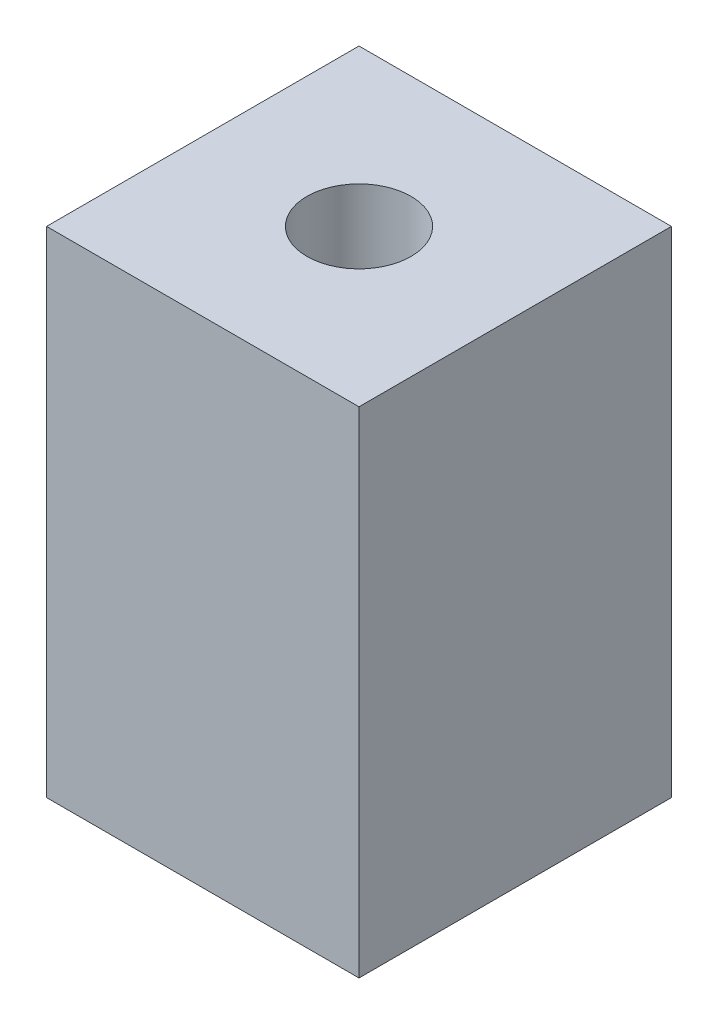
ISO-10303-21;
HEADER;
FILE_DESCRIPTION(('STEP AP214'),'2;1');
FILE_NAME('part.step','',(''),(''),'','','');
FILE_SCHEMA(('AUTOMOTIVE_DESIGN { 1 0 10303 214 1 1 1 1 }'));
ENDSEC;
DATA;
#1=APPLICATION_CONTEXT('core data for automotive mechanical design processes');
#2=APPLICATION_PROTOCOL_DEFINITION('international standard','automotive_design',2000,#1);
#3=PRODUCT_CONTEXT('',#1,'mechanical');
#4=PRODUCT('Part','Part','',(#3));
#5=PRODUCT_RELATED_PRODUCT_CATEGORY('part','',(#4));
#6=PRODUCT_DEFINITION_FORMATION('','',#4);
#7=PRODUCT_DEFINITION_CONTEXT('part definition',#1,'design');
#8=PRODUCT_DEFINITION('design','',#6,#7);
#9=PRODUCT_DEFINITION_SHAPE('','',#8);
#10=(LENGTH_UNIT() NAMED_UNIT(*) SI_UNIT(.MILLI.,.METRE.));
#11=(NAMED_UNIT(*) PLANE_ANGLE_UNIT() SI_UNIT($,.RADIAN.));
#12=(NAMED_UNIT(*) SI_UNIT($,.STERADIAN.) SOLID_ANGLE_UNIT());
#13=UNCERTAINTY_MEASURE_WITH_UNIT(LENGTH_MEASURE(1.E-05),#10,'distance_accuracy_value','');
#14=(GEOMETRIC_REPRESENTATION_CONTEXT(3) GLOBAL_UNCERTAINTY_ASSIGNED_CONTEXT((#13)) GLOBAL_UNIT_ASSIGNED_CONTEXT((#10,
#11,#12)) REPRESENTATION_CONTEXT('',''));
#15=CARTESIAN_POINT('',(0.,0.,0.));
#16=DIRECTION('',(0.,0.,1.));
#17=DIRECTION('',(1.,0.,0.));
#18=AXIS2_PLACEMENT_3D('',#15,#16,#17);
#19=CARTESIAN_POINT('',(0.,19.,0.));
#20=DIRECTION('',(0.,1.,0.));
#21=DIRECTION('',(0.,0.,1.));
#22=AXIS2_PLACEMENT_3D('',#19,#20,#21);
#23=PLANE('',#22);
#24=DIRECTION('',(0.,0.,-1.));
#25=VECTOR('',#24,1.);
#26=CARTESIAN_POINT('',(6.,19.,-6.));
#27=LINE('',#26,#25);
#28=CARTESIAN_POINT('',(6.,19.,6.));
#29=VERTEX_POINT('',#28);
#30=CARTESIAN_POINT('',(6.,19.,-6.));
#31=VERTEX_POINT('',#30);
#32=EDGE_CURVE('E89',#29,#31,#27,.T.);
#33=ORIENTED_EDGE('',*,*,#32,.T.);
#34=DIRECTION('',(-1.,0.,0.));
#35=VECTOR('',#34,1.);
#36=CARTESIAN_POINT('',(-6.,19.,-6.));
#37=LINE('',#36,#35);
#38=CARTESIAN_POINT('',(-6.,19.,-6.));
#39=VERTEX_POINT('',#38);
#40=EDGE_CURVE('E84',#31,#39,#37,.T.);
#41=ORIENTED_EDGE('',*,*,#40,.T.);
#42=DIRECTION('',(0.,0.,1.));
#43=VECTOR('',#42,1.);
#44=CARTESIAN_POINT('',(-6.,19.,-6.));
#45=LINE('',#44,#43);
#46=CARTESIAN_POINT('',(-6.,19.,6.));
#47=VERTEX_POINT('',#46);
#48=EDGE_CURVE('E87',#39,#47,#45,.T.);
#49=ORIENTED_EDGE('',*,*,#48,.T.);
#50=DIRECTION('',(1.,0.,0.));
#51=VECTOR('',#50,1.);
#52=CARTESIAN_POINT('',(-6.,19.,6.));
#53=LINE('',#52,#51);
#54=EDGE_CURVE('E54',#47,#29,#53,.T.);
#55=ORIENTED_EDGE('',*,*,#54,.T.);
#56=EDGE_LOOP('',(#33,#41,#49,#55));
#57=FACE_BOUND('',#56,.T.);
#58=CARTESIAN_POINT('',(0.,19.,0.));
#59=DIRECTION('',(0.,1.,0.));
#60=DIRECTION('',(0.,0.,1.));
#61=AXIS2_PLACEMENT_3D('',#58,#59,#60);
#62=CIRCLE('',#61,2.);
#63=CARTESIAN_POINT('',(0.,19.,2.));
#64=VERTEX_POINT('',#63);
#65=EDGE_CURVE('E104',#64,#64,#62,.T.);
#66=ORIENTED_EDGE('',*,*,#65,.F.);
#67=EDGE_LOOP('',(#66));
#68=FACE_BOUND('',#67,.T.);
#69=ADVANCED_FACE('F37',(#57,#68),#23,.T.);
#70=CARTESIAN_POINT('',(0.,0.,0.));
#71=DIRECTION('',(0.,1.,0.));
#72=DIRECTION('',(0.,0.,1.));
#73=AXIS2_PLACEMENT_3D('',#70,#71,#72);
#74=PLANE('',#73);
#75=DIRECTION('',(0.,0.,-1.));
#76=VECTOR('',#75,1.);
#77=CARTESIAN_POINT('',(6.,0.,-6.));
#78=LINE('',#77,#76);
#79=CARTESIAN_POINT('',(6.,0.,6.));
#80=VERTEX_POINT('',#79);
#81=CARTESIAN_POINT('',(6.,0.,-6.));
#82=VERTEX_POINT('',#81);
#83=EDGE_CURVE('E101',#80,#82,#78,.T.);
#84=ORIENTED_EDGE('',*,*,#83,.F.);
#85=DIRECTION('',(1.,0.,0.));
#86=VECTOR('',#85,1.);
#87=CARTESIAN_POINT('',(-6.,0.,6.));
#88=LINE('',#87,#86);
#89=CARTESIAN_POINT('',(-6.,0.,6.));
#90=VERTEX_POINT('',#89);
#91=EDGE_CURVE('E77',#90,#80,#88,.T.);
#92=ORIENTED_EDGE('',*,*,#91,.F.);
#93=DIRECTION('',(0.,0.,1.));
#94=VECTOR('',#93,1.);
#95=CARTESIAN_POINT('',(-6.,0.,-6.));
#96=LINE('',#95,#94);
#97=CARTESIAN_POINT('',(-6.,0.,-6.));
#98=VERTEX_POINT('',#97);
#99=EDGE_CURVE('E71',#98,#90,#96,.T.);
#100=ORIENTED_EDGE('',*,*,#99,.F.);
#101=DIRECTION('',(-1.,0.,0.));
#102=VECTOR('',#101,1.);
#103=CARTESIAN_POINT('',(-6.,0.,-6.));
#104=LINE('',#103,#102);
#105=EDGE_CURVE('E93',#82,#98,#104,.T.);
#106=ORIENTED_EDGE('',*,*,#105,.F.);
#107=EDGE_LOOP('',(#84,#92,#100,#106));
#108=FACE_BOUND('',#107,.T.);
#109=CARTESIAN_POINT('',(0.,0.,0.));
#110=DIRECTION('',(0.,1.,0.));
#111=DIRECTION('',(0.,0.,1.));
#112=AXIS2_PLACEMENT_3D('',#109,#110,#111);
#113=CIRCLE('',#112,2.);
#114=CARTESIAN_POINT('',(0.,0.,2.));
#115=VERTEX_POINT('',#114);
#116=EDGE_CURVE('E116',#115,#115,#113,.T.);
#117=ORIENTED_EDGE('',*,*,#116,.T.);
#118=EDGE_LOOP('',(#117));
#119=FACE_BOUND('',#118,.T.);
#120=ADVANCED_FACE('F112',(#108,#119),#74,.F.);
#121=CARTESIAN_POINT('',(6.,19.,-6.));
#122=DIRECTION('',(-1.,0.,0.));
#123=DIRECTION('',(0.,0.,1.));
#124=AXIS2_PLACEMENT_3D('',#121,#122,#123);
#125=PLANE('',#124);
#126=ORIENTED_EDGE('',*,*,#83,.T.);
#127=DIRECTION('',(0.,-1.,0.));
#128=VECTOR('',#127,1.);
#129=CARTESIAN_POINT('',(6.,19.,-6.));
#130=LINE('',#129,#128);
#131=EDGE_CURVE('E11',#31,#82,#130,.T.);
#132=ORIENTED_EDGE('',*,*,#131,.F.);
#133=ORIENTED_EDGE('',*,*,#32,.F.);
#134=DIRECTION('',(0.,-1.,0.));
#135=VECTOR('',#134,1.);
#136=CARTESIAN_POINT('',(6.,19.,6.));
#137=LINE('',#136,#135);
#138=EDGE_CURVE('E97',#29,#80,#137,.T.);
#139=ORIENTED_EDGE('',*,*,#138,.T.);
#140=EDGE_LOOP('',(#126,#132,#133,#139));
#141=FACE_BOUND('',#140,.T.);
#142=ADVANCED_FACE('F39',(#141),#125,.F.);
#143=CARTESIAN_POINT('',(-6.,19.,-6.));
#144=DIRECTION('',(0.,0.,1.));
#145=DIRECTION('',(1.,0.,0.));
#146=AXIS2_PLACEMENT_3D('',#143,#144,#145);
#147=PLANE('',#146);
#148=ORIENTED_EDGE('',*,*,#105,.T.);
#149=DIRECTION('',(0.,-1.,0.));
#150=VECTOR('',#149,1.);
#151=CARTESIAN_POINT('',(-6.,19.,-6.));
#152=LINE('',#151,#150);
#153=EDGE_CURVE('E46',#39,#98,#152,.T.);
#154=ORIENTED_EDGE('',*,*,#153,.F.);
#155=ORIENTED_EDGE('',*,*,#40,.F.);
#156=ORIENTED_EDGE('',*,*,#131,.T.);
#157=EDGE_LOOP('',(#148,#154,#155,#156));
#158=FACE_BOUND('',#157,.T.);
#159=ADVANCED_FACE('F92',(#158),#147,.F.);
#160=CARTESIAN_POINT('',(-6.,19.,-6.));
#161=DIRECTION('',(1.,0.,0.));
#162=DIRECTION('',(0.,0.,-1.));
#163=AXIS2_PLACEMENT_3D('',#160,#161,#162);
#164=PLANE('',#163);
#165=ORIENTED_EDGE('',*,*,#99,.T.);
#166=DIRECTION('',(0.,-1.,0.));
#167=VECTOR('',#166,1.);
#168=CARTESIAN_POINT('',(-6.,19.,6.));
#169=LINE('',#168,#167);
#170=EDGE_CURVE('E94',#47,#90,#169,.T.);
#171=ORIENTED_EDGE('',*,*,#170,.F.);
#172=ORIENTED_EDGE('',*,*,#48,.F.);
#173=ORIENTED_EDGE('',*,*,#153,.T.);
#174=EDGE_LOOP('',(#165,#171,#172,#173));
#175=FACE_BOUND('',#174,.T.);
#176=ADVANCED_FACE('F95',(#175),#164,.F.);
#177=CARTESIAN_POINT('',(-6.,19.,6.));
#178=DIRECTION('',(0.,0.,-1.));
#179=DIRECTION('',(-1.,0.,0.));
#180=AXIS2_PLACEMENT_3D('',#177,#178,#179);
#181=PLANE('',#180);
#182=ORIENTED_EDGE('',*,*,#91,.T.);
#183=ORIENTED_EDGE('',*,*,#138,.F.);
#184=ORIENTED_EDGE('',*,*,#54,.F.);
#185=ORIENTED_EDGE('',*,*,#170,.T.);
#186=EDGE_LOOP('',(#182,#183,#184,#185));
#187=FACE_BOUND('',#186,.T.);
#188=ADVANCED_FACE('F109',(#187),#181,.F.);
#189=CARTESIAN_POINT('',(0.,19.,0.));
#190=DIRECTION('',(0.,-1.,0.));
#191=DIRECTION('',(0.,0.,-1.));
#192=AXIS2_PLACEMENT_3D('',#189,#190,#191);
#193=CYLINDRICAL_SURFACE('',#192,2.);
#194=ORIENTED_EDGE('',*,*,#65,.T.);
#195=EDGE_LOOP('',(#194));
#196=FACE_BOUND('',#195,.T.);
#197=ORIENTED_EDGE('',*,*,#116,.F.);
#198=EDGE_LOOP('',(#197));
#199=FACE_BOUND('',#198,.T.);
#200=ADVANCED_FACE('F122',(#196,#199),#193,.F.);
#201=CLOSED_SHELL('',(#69,#120,#142,#159,#176,#188,#200));
#202=MANIFOLD_SOLID_BREP('B2',#201);
#203=ADVANCED_BREP_SHAPE_REPRESENTATION('',(#18,#202),#14);
#204=SHAPE_DEFINITION_REPRESENTATION(#9,#203);
ENDSEC;
END-ISO-10303-21;
